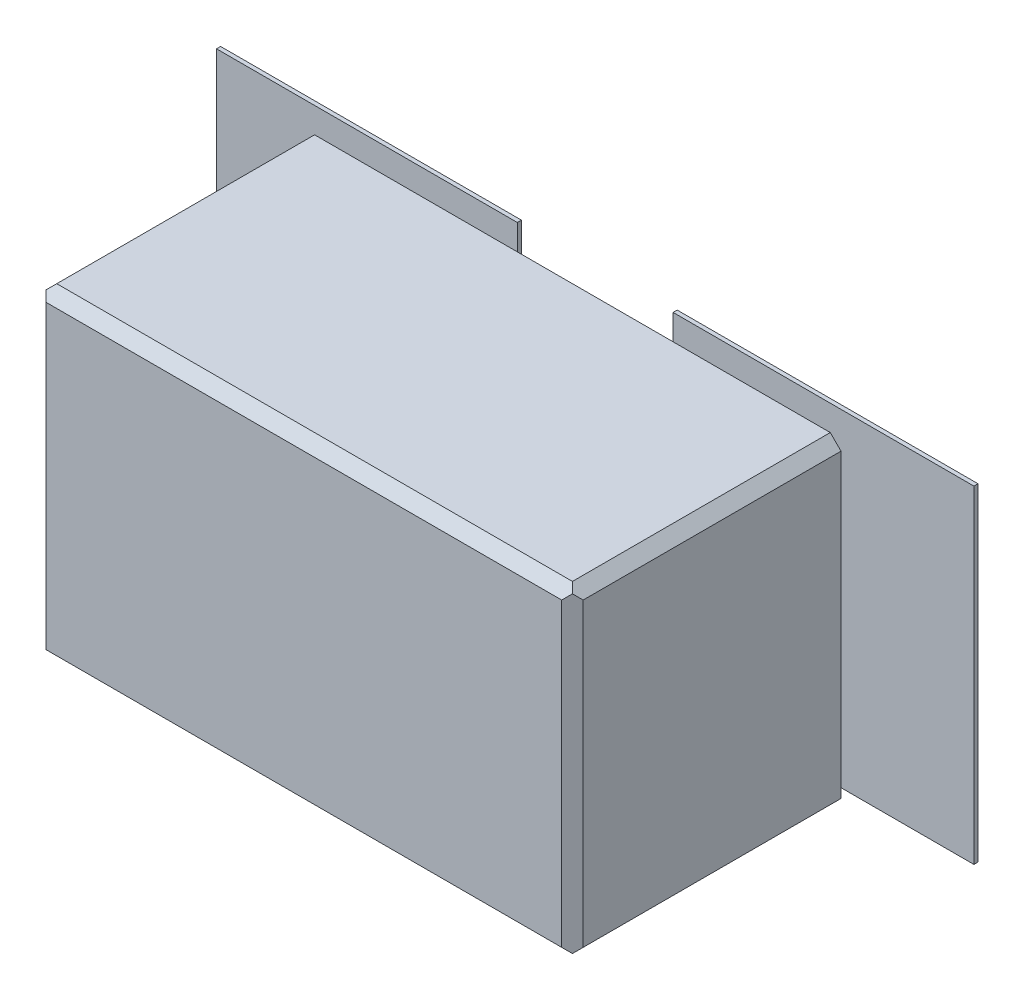
ISO-10303-21;
HEADER;
FILE_DESCRIPTION(('STEP AP214'),'2;1');
FILE_NAME('part.step','',(''),(''),'','','');
FILE_SCHEMA(('AUTOMOTIVE_DESIGN { 1 0 10303 214 1 1 1 1 }'));
ENDSEC;
DATA;
#1=APPLICATION_CONTEXT('core data for automotive mechanical design processes');
#2=APPLICATION_PROTOCOL_DEFINITION('international standard','automotive_design',2000,#1);
#3=PRODUCT_CONTEXT('',#1,'mechanical');
#4=PRODUCT('Part','Part','',(#3));
#5=PRODUCT_RELATED_PRODUCT_CATEGORY('part','',(#4));
#6=PRODUCT_DEFINITION_FORMATION('','',#4);
#7=PRODUCT_DEFINITION_CONTEXT('part definition',#1,'design');
#8=PRODUCT_DEFINITION('design','',#6,#7);
#9=PRODUCT_DEFINITION_SHAPE('','',#8);
#10=(LENGTH_UNIT() NAMED_UNIT(*) SI_UNIT(.MILLI.,.METRE.));
#11=(NAMED_UNIT(*) PLANE_ANGLE_UNIT() SI_UNIT($,.RADIAN.));
#12=(NAMED_UNIT(*) SI_UNIT($,.STERADIAN.) SOLID_ANGLE_UNIT());
#13=UNCERTAINTY_MEASURE_WITH_UNIT(LENGTH_MEASURE(1.E-05),#10,'distance_accuracy_value','');
#14=(GEOMETRIC_REPRESENTATION_CONTEXT(3) GLOBAL_UNCERTAINTY_ASSIGNED_CONTEXT((#13)) GLOBAL_UNIT_ASSIGNED_CONTEXT((#10,
#11,#12)) REPRESENTATION_CONTEXT('',''));
#15=CARTESIAN_POINT('',(0.,0.,0.));
#16=DIRECTION('',(0.,0.,1.));
#17=DIRECTION('',(1.,0.,0.));
#18=AXIS2_PLACEMENT_3D('',#15,#16,#17);
#19=CARTESIAN_POINT('',(0.,0.,0.08382));
#20=DIRECTION('',(0.,0.,1.));
#21=DIRECTION('',(1.,0.,0.));
#22=AXIS2_PLACEMENT_3D('',#19,#20,#21);
#23=PLANE('',#22);
#24=DIRECTION('',(0.,1.,0.));
#25=VECTOR('',#24,1.);
#26=CARTESIAN_POINT('',(-0.705,0.305,0.08382));
#27=LINE('',#26,#25);
#28=CARTESIAN_POINT('',(-0.705,-0.305,0.08382));
#29=VERTEX_POINT('',#28);
#30=CARTESIAN_POINT('',(-0.705,0.305,0.08382));
#31=VERTEX_POINT('',#30);
#32=EDGE_CURVE('P0_E68',#29,#31,#27,.T.);
#33=ORIENTED_EDGE('',*,*,#32,.F.);
#34=DIRECTION('',(1.,0.,0.));
#35=VECTOR('',#34,1.);
#36=CARTESIAN_POINT('',(-0.705,-0.305,0.08382));
#37=LINE('',#36,#35);
#38=CARTESIAN_POINT('',(-0.145,-0.305,0.08382));
#39=VERTEX_POINT('',#38);
#40=EDGE_CURVE('P0_E20',#39,#29,#37,.F.);
#41=ORIENTED_EDGE('',*,*,#40,.F.);
#42=DIRECTION('',(0.,1.,0.));
#43=VECTOR('',#42,1.);
#44=CARTESIAN_POINT('',(-0.145,-0.305,0.08382));
#45=LINE('',#44,#43);
#46=CARTESIAN_POINT('',(-0.145,0.305,0.08382));
#47=VERTEX_POINT('',#46);
#48=EDGE_CURVE('P0_E58',#47,#39,#45,.F.);
#49=ORIENTED_EDGE('',*,*,#48,.F.);
#50=DIRECTION('',(1.,0.,0.));
#51=VECTOR('',#50,1.);
#52=CARTESIAN_POINT('',(-0.145,0.305,0.08382));
#53=LINE('',#52,#51);
#54=EDGE_CURVE('P0_E53',#31,#47,#53,.T.);
#55=ORIENTED_EDGE('',*,*,#54,.F.);
#56=EDGE_LOOP('',(#33,#41,#49,#55));
#57=FACE_BOUND('',#56,.T.);
#58=ADVANCED_FACE('P0_F17',(#57),#23,.T.);
#59=CARTESIAN_POINT('',(-0.705,-0.305,0.0762));
#60=DIRECTION('',(0.,-1.,0.));
#61=DIRECTION('',(0.,0.,-1.));
#62=AXIS2_PLACEMENT_3D('',#59,#60,#61);
#63=PLANE('',#62);
#64=DIRECTION('',(0.,0.,1.));
#65=VECTOR('',#64,1.);
#66=CARTESIAN_POINT('',(-0.705,-0.305,0.0762));
#67=LINE('',#66,#65);
#68=CARTESIAN_POINT('',(-0.705,-0.305,0.0762));
#69=VERTEX_POINT('',#68);
#70=EDGE_CURVE('P0_E79',#69,#29,#67,.T.);
#71=ORIENTED_EDGE('',*,*,#70,.F.);
#72=DIRECTION('',(1.,0.,0.));
#73=VECTOR('',#72,1.);
#74=CARTESIAN_POINT('',(0.,-0.305,0.0762));
#75=LINE('',#74,#73);
#76=CARTESIAN_POINT('',(-0.145,-0.305,0.0762));
#77=VERTEX_POINT('',#76);
#78=EDGE_CURVE('P0_E74',#69,#77,#75,.T.);
#79=ORIENTED_EDGE('',*,*,#78,.T.);
#80=DIRECTION('',(0.,0.,-1.));
#81=VECTOR('',#80,1.);
#82=CARTESIAN_POINT('',(-0.145,-0.305,0.0762));
#83=LINE('',#82,#81);
#84=EDGE_CURVE('P0_E63',#39,#77,#83,.T.);
#85=ORIENTED_EDGE('',*,*,#84,.F.);
#86=ORIENTED_EDGE('',*,*,#40,.T.);
#87=EDGE_LOOP('',(#71,#79,#85,#86));
#88=FACE_BOUND('',#87,.T.);
#89=ADVANCED_FACE('P0_F73',(#88),#63,.T.);
#90=CARTESIAN_POINT('',(-0.145,-0.305,0.0762));
#91=DIRECTION('',(1.,0.,0.));
#92=DIRECTION('',(0.,0.,-1.));
#93=AXIS2_PLACEMENT_3D('',#90,#91,#92);
#94=PLANE('',#93);
#95=ORIENTED_EDGE('',*,*,#84,.T.);
#96=DIRECTION('',(0.,1.,0.));
#97=VECTOR('',#96,1.);
#98=CARTESIAN_POINT('',(-0.145,0.,0.0762));
#99=LINE('',#98,#97);
#100=CARTESIAN_POINT('',(-0.145,0.305,0.0762));
#101=VERTEX_POINT('',#100);
#102=EDGE_CURVE('P0_E84',#77,#101,#99,.T.);
#103=ORIENTED_EDGE('',*,*,#102,.T.);
#104=DIRECTION('',(0.,0.,1.));
#105=VECTOR('',#104,1.);
#106=CARTESIAN_POINT('',(-0.145,0.305,0.0762));
#107=LINE('',#106,#105);
#108=EDGE_CURVE('P0_E65',#47,#101,#107,.F.);
#109=ORIENTED_EDGE('',*,*,#108,.F.);
#110=ORIENTED_EDGE('',*,*,#48,.T.);
#111=EDGE_LOOP('',(#95,#103,#109,#110));
#112=FACE_BOUND('',#111,.T.);
#113=ADVANCED_FACE('P0_F60',(#112),#94,.T.);
#114=CARTESIAN_POINT('',(-0.145,0.305,0.0762));
#115=DIRECTION('',(0.,1.,0.));
#116=DIRECTION('',(0.,0.,1.));
#117=AXIS2_PLACEMENT_3D('',#114,#115,#116);
#118=PLANE('',#117);
#119=ORIENTED_EDGE('',*,*,#108,.T.);
#120=DIRECTION('',(1.,0.,0.));
#121=VECTOR('',#120,1.);
#122=CARTESIAN_POINT('',(0.,0.305,0.0762));
#123=LINE('',#122,#121);
#124=CARTESIAN_POINT('',(-0.705,0.305,0.0762));
#125=VERTEX_POINT('',#124);
#126=EDGE_CURVE('P0_E26',#101,#125,#123,.F.);
#127=ORIENTED_EDGE('',*,*,#126,.T.);
#128=DIRECTION('',(0.,0.,1.));
#129=VECTOR('',#128,1.);
#130=CARTESIAN_POINT('',(-0.705,0.305,0.0762));
#131=LINE('',#130,#129);
#132=EDGE_CURVE('P0_E34',#31,#125,#131,.F.);
#133=ORIENTED_EDGE('',*,*,#132,.F.);
#134=ORIENTED_EDGE('',*,*,#54,.T.);
#135=EDGE_LOOP('',(#119,#127,#133,#134));
#136=FACE_BOUND('',#135,.T.);
#137=ADVANCED_FACE('P0_F88',(#136),#118,.T.);
#138=CARTESIAN_POINT('',(-0.705,0.305,0.0762));
#139=DIRECTION('',(-1.,0.,0.));
#140=DIRECTION('',(0.,0.,1.));
#141=AXIS2_PLACEMENT_3D('',#138,#139,#140);
#142=PLANE('',#141);
#143=ORIENTED_EDGE('',*,*,#132,.T.);
#144=DIRECTION('',(0.,1.,0.));
#145=VECTOR('',#144,1.);
#146=CARTESIAN_POINT('',(-0.705,0.,0.0762));
#147=LINE('',#146,#145);
#148=EDGE_CURVE('P0_E11',#125,#69,#147,.F.);
#149=ORIENTED_EDGE('',*,*,#148,.T.);
#150=ORIENTED_EDGE('',*,*,#70,.T.);
#151=ORIENTED_EDGE('',*,*,#32,.T.);
#152=EDGE_LOOP('',(#143,#149,#150,#151));
#153=FACE_BOUND('',#152,.T.);
#154=ADVANCED_FACE('P0_F91',(#153),#142,.T.);
#155=CARTESIAN_POINT('',(0.,0.,0.0762));
#156=DIRECTION('',(0.,0.,1.));
#157=DIRECTION('',(1.,0.,0.));
#158=AXIS2_PLACEMENT_3D('',#155,#156,#157);
#159=PLANE('',#158);
#160=ORIENTED_EDGE('',*,*,#126,.F.);
#161=ORIENTED_EDGE('',*,*,#102,.F.);
#162=ORIENTED_EDGE('',*,*,#78,.F.);
#163=ORIENTED_EDGE('',*,*,#148,.F.);
#164=EDGE_LOOP('',(#160,#161,#162,#163));
#165=FACE_BOUND('',#164,.T.);
#166=ADVANCED_FACE('P0_F90',(#165),#159,.F.);
#167=CLOSED_SHELL('',(#58,#89,#113,#137,#154,#166));
#168=MANIFOLD_SOLID_BREP('P0_B1',#167);
#169=CARTESIAN_POINT('',(0.,0.,0.0862));
#170=DIRECTION('',(0.,0.,-1.));
#171=DIRECTION('',(-1.,0.,0.));
#172=AXIS2_PLACEMENT_3D('',#169,#170,#171);
#173=PLANE('',#172);
#174=DIRECTION('',(1.,0.,0.));
#175=VECTOR('',#174,1.);
#176=CARTESIAN_POINT('',(-0.4159973957868,0.25,0.0862));
#177=LINE('',#176,#175);
#178=CARTESIAN_POINT('',(-0.2159973957868,0.25,0.0862));
#179=VERTEX_POINT('',#178);
#180=CARTESIAN_POINT('',(-0.4159973957868,0.25,0.0862));
#181=VERTEX_POINT('',#180);
#182=EDGE_CURVE('P1_E184',#179,#181,#177,.F.);
#183=ORIENTED_EDGE('',*,*,#182,.F.);
#184=DIRECTION('',(0.,1.,0.));
#185=VECTOR('',#184,1.);
#186=CARTESIAN_POINT('',(-0.2159973957868,0.25,0.0862));
#187=LINE('',#186,#185);
#188=CARTESIAN_POINT('',(-0.2159973957868,-0.25,0.0862));
#189=VERTEX_POINT('',#188);
#190=EDGE_CURVE('P1_E212',#189,#179,#187,.T.);
#191=ORIENTED_EDGE('',*,*,#190,.F.);
#192=DIRECTION('',(1.,0.,0.));
#193=VECTOR('',#192,1.);
#194=CARTESIAN_POINT('',(-0.2159973957868,-0.25,0.0862));
#195=LINE('',#194,#193);
#196=CARTESIAN_POINT('',(-0.4659973957868,-0.25,0.0862));
#197=VERTEX_POINT('',#196);
#198=EDGE_CURVE('P1_E163',#197,#189,#195,.T.);
#199=ORIENTED_EDGE('',*,*,#198,.F.);
#200=DIRECTION('',(0.,1.,0.));
#201=VECTOR('',#200,1.);
#202=CARTESIAN_POINT('',(-0.4659973957868,-0.25,0.0862));
#203=LINE('',#202,#201);
#204=CARTESIAN_POINT('',(-0.4659973957868,0.2,0.0862));
#205=VERTEX_POINT('',#204);
#206=EDGE_CURVE('P1_E157',#205,#197,#203,.F.);
#207=ORIENTED_EDGE('',*,*,#206,.F.);
#208=CARTESIAN_POINT('',(-0.4659973957868,0.25,0.0862));
#209=DIRECTION('',(0.,0.,-1.));
#210=DIRECTION('',(-1.,0.,0.));
#211=AXIS2_PLACEMENT_3D('',#208,#209,#210);
#212=CIRCLE('',#211,0.05);
#213=EDGE_CURVE('P1_E20',#205,#181,#212,.F.);
#214=ORIENTED_EDGE('',*,*,#213,.T.);
#215=EDGE_LOOP('',(#183,#191,#199,#207,#214));
#216=FACE_BOUND('',#215,.T.);
#217=ADVANCED_FACE('P1_F17',(#216),#173,.T.);
#218=CARTESIAN_POINT('',(0.,0.,0.0862));
#219=DIRECTION('',(0.,0.,-1.));
#220=DIRECTION('',(-1.,0.,0.));
#221=AXIS2_PLACEMENT_3D('',#218,#219,#220);
#222=PLANE('',#221);
#223=DIRECTION('',(1.,0.,0.));
#224=VECTOR('',#223,1.);
#225=CARTESIAN_POINT('',(0.1840026042132,0.25,0.0862));
#226=LINE('',#225,#224);
#227=CARTESIAN_POINT('',(0.4340026042132,0.25,0.0862));
#228=VERTEX_POINT('',#227);
#229=CARTESIAN_POINT('',(0.1840026042132,0.25,0.0862));
#230=VERTEX_POINT('',#229);
#231=EDGE_CURVE('P1_E232',#228,#230,#226,.F.);
#232=ORIENTED_EDGE('',*,*,#231,.F.);
#233=DIRECTION('',(0.,1.,0.));
#234=VECTOR('',#233,1.);
#235=CARTESIAN_POINT('',(0.4340026042132,0.25,0.0862));
#236=LINE('',#235,#234);
#237=CARTESIAN_POINT('',(0.4340026042132,-0.25,0.0862));
#238=VERTEX_POINT('',#237);
#239=EDGE_CURVE('P1_E249',#238,#228,#236,.T.);
#240=ORIENTED_EDGE('',*,*,#239,.F.);
#241=DIRECTION('',(1.,0.,0.));
#242=VECTOR('',#241,1.);
#243=CARTESIAN_POINT('',(0.4340026042132,-0.25,0.0862));
#244=LINE('',#243,#242);
#245=CARTESIAN_POINT('',(0.1840026042132,-0.25,0.0862));
#246=VERTEX_POINT('',#245);
#247=EDGE_CURVE('P1_E247',#246,#238,#244,.T.);
#248=ORIENTED_EDGE('',*,*,#247,.F.);
#249=DIRECTION('',(0.,1.,0.));
#250=VECTOR('',#249,1.);
#251=CARTESIAN_POINT('',(0.1840026042132,-0.25,0.0862));
#252=LINE('',#251,#250);
#253=EDGE_CURVE('P1_E241',#230,#246,#252,.F.);
#254=ORIENTED_EDGE('',*,*,#253,.F.);
#255=EDGE_LOOP('',(#232,#240,#248,#254));
#256=FACE_BOUND('',#255,.T.);
#257=ADVANCED_FACE('P1_F273',(#256),#222,.T.);
#258=CARTESIAN_POINT('',(-0.2159973957868,0.25,0.1262));
#259=DIRECTION('',(1.,0.,0.));
#260=DIRECTION('',(0.,0.,-1.));
#261=AXIS2_PLACEMENT_3D('',#258,#259,#260);
#262=PLANE('',#261);
#263=DIRECTION('',(0.,0.,1.));
#264=VECTOR('',#263,1.);
#265=CARTESIAN_POINT('',(-0.2159973957868,0.25,0.1262));
#266=LINE('',#265,#264);
#267=CARTESIAN_POINT('',(-0.2159973957868,0.25,0.1262));
#268=VERTEX_POINT('',#267);
#269=EDGE_CURVE('P1_E182',#268,#179,#266,.F.);
#270=ORIENTED_EDGE('',*,*,#269,.F.);
#271=DIRECTION('',(0.,1.,0.));
#272=VECTOR('',#271,1.);
#273=CARTESIAN_POINT('',(-0.2159973957868,0.,0.1262));
#274=LINE('',#273,#272);
#275=CARTESIAN_POINT('',(-0.2159973957868,-0.25,0.1262));
#276=VERTEX_POINT('',#275);
#277=EDGE_CURVE('P1_E194',#268,#276,#274,.F.);
#278=ORIENTED_EDGE('',*,*,#277,.T.);
#279=DIRECTION('',(0.,0.,-1.));
#280=VECTOR('',#279,1.);
#281=CARTESIAN_POINT('',(-0.2159973957868,-0.25,0.1262));
#282=LINE('',#281,#280);
#283=EDGE_CURVE('P1_E168',#189,#276,#282,.F.);
#284=ORIENTED_EDGE('',*,*,#283,.F.);
#285=ORIENTED_EDGE('',*,*,#190,.T.);
#286=EDGE_LOOP('',(#270,#278,#284,#285));
#287=FACE_BOUND('',#286,.T.);
#288=ADVANCED_FACE('P1_F262',(#287),#262,.T.);
#289=CARTESIAN_POINT('',(-0.2159973957868,-0.25,0.1262));
#290=DIRECTION('',(0.,-1.,0.));
#291=DIRECTION('',(0.,0.,-1.));
#292=AXIS2_PLACEMENT_3D('',#289,#290,#291);
#293=PLANE('',#292);
#294=ORIENTED_EDGE('',*,*,#283,.T.);
#295=DIRECTION('',(1.,0.,0.));
#296=VECTOR('',#295,1.);
#297=CARTESIAN_POINT('',(0.,-0.25,0.1262));
#298=LINE('',#297,#296);
#299=CARTESIAN_POINT('',(-0.4659973957868,-0.25,0.1262));
#300=VERTEX_POINT('',#299);
#301=EDGE_CURVE('P1_E196',#276,#300,#298,.F.);
#302=ORIENTED_EDGE('',*,*,#301,.T.);
#303=DIRECTION('',(0.,0.,1.));
#304=VECTOR('',#303,1.);
#305=CARTESIAN_POINT('',(-0.4659973957868,-0.25,0.1262));
#306=LINE('',#305,#304);
#307=EDGE_CURVE('P1_E167',#197,#300,#306,.T.);
#308=ORIENTED_EDGE('',*,*,#307,.F.);
#309=ORIENTED_EDGE('',*,*,#198,.T.);
#310=EDGE_LOOP('',(#294,#302,#308,#309));
#311=FACE_BOUND('',#310,.T.);
#312=ADVANCED_FACE('P1_F264',(#311),#293,.T.);
#313=CARTESIAN_POINT('',(-0.4659973957868,-0.25,0.1262));
#314=DIRECTION('',(-1.,0.,0.));
#315=DIRECTION('',(0.,0.,1.));
#316=AXIS2_PLACEMENT_3D('',#313,#314,#315);
#317=PLANE('',#316);
#318=ORIENTED_EDGE('',*,*,#307,.T.);
#319=DIRECTION('',(0.,1.,0.));
#320=VECTOR('',#319,1.);
#321=CARTESIAN_POINT('',(-0.4659973957868,0.,0.1262));
#322=LINE('',#321,#320);
#323=CARTESIAN_POINT('',(-0.4659973957868,0.2,0.1262));
#324=VERTEX_POINT('',#323);
#325=EDGE_CURVE('P1_E174',#300,#324,#322,.T.);
#326=ORIENTED_EDGE('',*,*,#325,.T.);
#327=DIRECTION('',(0.,0.,-1.));
#328=VECTOR('',#327,1.);
#329=CARTESIAN_POINT('',(-0.4659973957868,0.2,0.1262));
#330=LINE('',#329,#328);
#331=EDGE_CURVE('P1_E171',#324,#205,#330,.T.);
#332=ORIENTED_EDGE('',*,*,#331,.T.);
#333=ORIENTED_EDGE('',*,*,#206,.T.);
#334=EDGE_LOOP('',(#318,#326,#332,#333));
#335=FACE_BOUND('',#334,.T.);
#336=ADVANCED_FACE('P1_F172',(#335),#317,.T.);
#337=CARTESIAN_POINT('',(-0.4659973957868,0.25,0.1262));
#338=DIRECTION('',(0.,0.,-1.));
#339=DIRECTION('',(-1.,0.,0.));
#340=AXIS2_PLACEMENT_3D('',#337,#338,#339);
#341=CYLINDRICAL_SURFACE('',#340,0.05);
#342=ORIENTED_EDGE('',*,*,#213,.F.);
#343=ORIENTED_EDGE('',*,*,#331,.F.);
#344=CARTESIAN_POINT('',(-0.4659973957868,0.25,0.1262));
#345=DIRECTION('',(0.,0.,-1.));
#346=DIRECTION('',(-1.,0.,0.));
#347=AXIS2_PLACEMENT_3D('',#344,#345,#346);
#348=CIRCLE('',#347,0.05);
#349=CARTESIAN_POINT('',(-0.4159973957868,0.25,0.1262));
#350=VERTEX_POINT('',#349);
#351=EDGE_CURVE('P1_E220',#324,#350,#348,.F.);
#352=ORIENTED_EDGE('',*,*,#351,.T.);
#353=DIRECTION('',(0.,0.,1.));
#354=VECTOR('',#353,1.);
#355=CARTESIAN_POINT('',(-0.4159973957868,0.25,0.1262));
#356=LINE('',#355,#354);
#357=EDGE_CURVE('P1_E180',#181,#350,#356,.T.);
#358=ORIENTED_EDGE('',*,*,#357,.F.);
#359=EDGE_LOOP('',(#342,#343,#352,#358));
#360=FACE_BOUND('',#359,.T.);
#361=ADVANCED_FACE('P1_F178',(#360),#341,.F.);
#362=CARTESIAN_POINT('',(-0.4159973957868,0.25,0.1262));
#363=DIRECTION('',(0.,1.,0.));
#364=DIRECTION('',(0.,0.,1.));
#365=AXIS2_PLACEMENT_3D('',#362,#363,#364);
#366=PLANE('',#365);
#367=ORIENTED_EDGE('',*,*,#357,.T.);
#368=DIRECTION('',(1.,0.,0.));
#369=VECTOR('',#368,1.);
#370=CARTESIAN_POINT('',(0.,0.25,0.1262));
#371=LINE('',#370,#369);
#372=EDGE_CURVE('P1_E221',#350,#268,#371,.T.);
#373=ORIENTED_EDGE('',*,*,#372,.T.);
#374=ORIENTED_EDGE('',*,*,#269,.T.);
#375=ORIENTED_EDGE('',*,*,#182,.T.);
#376=EDGE_LOOP('',(#367,#373,#374,#375));
#377=FACE_BOUND('',#376,.T.);
#378=ADVANCED_FACE('P1_F254',(#377),#366,.T.);
#379=CARTESIAN_POINT('',(0.4340026042132,0.25,0.1262));
#380=DIRECTION('',(1.,0.,0.));
#381=DIRECTION('',(0.,0.,-1.));
#382=AXIS2_PLACEMENT_3D('',#379,#380,#381);
#383=PLANE('',#382);
#384=DIRECTION('',(0.,0.,1.));
#385=VECTOR('',#384,1.);
#386=CARTESIAN_POINT('',(0.4340026042132,0.25,0.1262));
#387=LINE('',#386,#385);
#388=CARTESIAN_POINT('',(0.4340026042132,0.25,0.1262));
#389=VERTEX_POINT('',#388);
#390=EDGE_CURVE('P1_E235',#389,#228,#387,.F.);
#391=ORIENTED_EDGE('',*,*,#390,.F.);
#392=DIRECTION('',(0.,1.,0.));
#393=VECTOR('',#392,1.);
#394=CARTESIAN_POINT('',(0.4340026042132,0.,0.1262));
#395=LINE('',#394,#393);
#396=CARTESIAN_POINT('',(0.4340026042132,-0.25,0.1262));
#397=VERTEX_POINT('',#396);
#398=EDGE_CURVE('P1_E222',#389,#397,#395,.F.);
#399=ORIENTED_EDGE('',*,*,#398,.T.);
#400=DIRECTION('',(0.,0.,-1.));
#401=VECTOR('',#400,1.);
#402=CARTESIAN_POINT('',(0.4340026042132,-0.25,0.1262));
#403=LINE('',#402,#401);
#404=EDGE_CURVE('P1_E244',#238,#397,#403,.F.);
#405=ORIENTED_EDGE('',*,*,#404,.F.);
#406=ORIENTED_EDGE('',*,*,#239,.T.);
#407=EDGE_LOOP('',(#391,#399,#405,#406));
#408=FACE_BOUND('',#407,.T.);
#409=ADVANCED_FACE('P1_F344',(#408),#383,.T.);
#410=CARTESIAN_POINT('',(0.4340026042132,-0.25,0.1262));
#411=DIRECTION('',(0.,-1.,0.));
#412=DIRECTION('',(0.,0.,-1.));
#413=AXIS2_PLACEMENT_3D('',#410,#411,#412);
#414=PLANE('',#413);
#415=ORIENTED_EDGE('',*,*,#404,.T.);
#416=DIRECTION('',(1.,0.,0.));
#417=VECTOR('',#416,1.);
#418=CARTESIAN_POINT('',(0.,-0.25,0.1262));
#419=LINE('',#418,#417);
#420=CARTESIAN_POINT('',(0.1840026042132,-0.25,0.1262));
#421=VERTEX_POINT('',#420);
#422=EDGE_CURVE('P1_E513',#397,#421,#419,.F.);
#423=ORIENTED_EDGE('',*,*,#422,.T.);
#424=DIRECTION('',(0.,0.,1.));
#425=VECTOR('',#424,1.);
#426=CARTESIAN_POINT('',(0.1840026042132,-0.25,0.1262));
#427=LINE('',#426,#425);
#428=EDGE_CURVE('P1_E238',#246,#421,#427,.T.);
#429=ORIENTED_EDGE('',*,*,#428,.F.);
#430=ORIENTED_EDGE('',*,*,#247,.T.);
#431=EDGE_LOOP('',(#415,#423,#429,#430));
#432=FACE_BOUND('',#431,.T.);
#433=ADVANCED_FACE('P1_F340',(#432),#414,.T.);
#434=CARTESIAN_POINT('',(0.1840026042132,-0.25,0.1262));
#435=DIRECTION('',(-1.,0.,0.));
#436=DIRECTION('',(0.,0.,1.));
#437=AXIS2_PLACEMENT_3D('',#434,#435,#436);
#438=PLANE('',#437);
#439=ORIENTED_EDGE('',*,*,#428,.T.);
#440=DIRECTION('',(0.,1.,0.));
#441=VECTOR('',#440,1.);
#442=CARTESIAN_POINT('',(0.1840026042132,0.,0.1262));
#443=LINE('',#442,#441);
#444=CARTESIAN_POINT('',(0.1840026042132,0.25,0.1262));
#445=VERTEX_POINT('',#444);
#446=EDGE_CURVE('P1_E517',#421,#445,#443,.T.);
#447=ORIENTED_EDGE('',*,*,#446,.T.);
#448=DIRECTION('',(0.,0.,1.));
#449=VECTOR('',#448,1.);
#450=CARTESIAN_POINT('',(0.1840026042132,0.25,0.1262));
#451=LINE('',#450,#449);
#452=EDGE_CURVE('P1_E197',#230,#445,#451,.T.);
#453=ORIENTED_EDGE('',*,*,#452,.F.);
#454=ORIENTED_EDGE('',*,*,#253,.T.);
#455=EDGE_LOOP('',(#439,#447,#453,#454));
#456=FACE_BOUND('',#455,.T.);
#457=ADVANCED_FACE('P1_F336',(#456),#438,.T.);
#458=CARTESIAN_POINT('',(0.1840026042132,0.25,0.1262));
#459=DIRECTION('',(0.,1.,0.));
#460=DIRECTION('',(0.,0.,1.));
#461=AXIS2_PLACEMENT_3D('',#458,#459,#460);
#462=PLANE('',#461);
#463=ORIENTED_EDGE('',*,*,#452,.T.);
#464=DIRECTION('',(1.,0.,0.));
#465=VECTOR('',#464,1.);
#466=CARTESIAN_POINT('',(0.,0.25,0.1262));
#467=LINE('',#466,#465);
#468=EDGE_CURVE('P1_E510',#445,#389,#467,.T.);
#469=ORIENTED_EDGE('',*,*,#468,.T.);
#470=ORIENTED_EDGE('',*,*,#390,.T.);
#471=ORIENTED_EDGE('',*,*,#231,.T.);
#472=EDGE_LOOP('',(#463,#469,#470,#471));
#473=FACE_BOUND('',#472,.T.);
#474=ADVANCED_FACE('P1_F332',(#473),#462,.T.);
#475=CARTESIAN_POINT('',(0.,0.,0.1262));
#476=DIRECTION('',(0.,0.,1.));
#477=DIRECTION('',(1.,0.,0.));
#478=AXIS2_PLACEMENT_3D('',#475,#476,#477);
#479=PLANE('',#478);
#480=ORIENTED_EDGE('',*,*,#446,.F.);
#481=ORIENTED_EDGE('',*,*,#422,.F.);
#482=ORIENTED_EDGE('',*,*,#398,.F.);
#483=ORIENTED_EDGE('',*,*,#468,.F.);
#484=EDGE_LOOP('',(#480,#481,#482,#483));
#485=FACE_BOUND('',#484,.T.);
#486=ORIENTED_EDGE('',*,*,#351,.F.);
#487=ORIENTED_EDGE('',*,*,#325,.F.);
#488=ORIENTED_EDGE('',*,*,#301,.F.);
#489=ORIENTED_EDGE('',*,*,#277,.F.);
#490=ORIENTED_EDGE('',*,*,#372,.F.);
#491=EDGE_LOOP('',(#486,#487,#488,#489,#490));
#492=FACE_BOUND('',#491,.T.);
#493=DIRECTION('',(0.707106781186548,0.707106781186548,0.));
#494=VECTOR('',#493,1.);
#495=CARTESIAN_POINT('',(0.49,-0.29,0.1262));
#496=LINE('',#495,#494);
#497=CARTESIAN_POINT('',(0.48,-0.3,0.1262));
#498=VERTEX_POINT('',#497);
#499=CARTESIAN_POINT('',(0.5,-0.28,0.1262));
#500=VERTEX_POINT('',#499);
#501=EDGE_CURVE('P1_E552',#498,#500,#496,.T.);
#502=ORIENTED_EDGE('',*,*,#501,.F.);
#503=DIRECTION('',(1.,0.,0.));
#504=VECTOR('',#503,1.);
#505=CARTESIAN_POINT('',(-0.5,-0.3,0.1262));
#506=LINE('',#505,#504);
#507=CARTESIAN_POINT('',(-0.48,-0.3,0.1262));
#508=VERTEX_POINT('',#507);
#509=EDGE_CURVE('P1_E542',#508,#498,#506,.T.);
#510=ORIENTED_EDGE('',*,*,#509,.F.);
#511=DIRECTION('',(0.707106781186548,-0.707106781186548,0.));
#512=VECTOR('',#511,1.);
#513=CARTESIAN_POINT('',(-0.49,-0.29,0.1262));
#514=LINE('',#513,#512);
#515=CARTESIAN_POINT('',(-0.5,-0.28,0.1262));
#516=VERTEX_POINT('',#515);
#517=EDGE_CURVE('P1_E537',#516,#508,#514,.T.);
#518=ORIENTED_EDGE('',*,*,#517,.F.);
#519=DIRECTION('',(0.,1.,0.));
#520=VECTOR('',#519,1.);
#521=CARTESIAN_POINT('',(-0.5,0.3,0.1262));
#522=LINE('',#521,#520);
#523=CARTESIAN_POINT('',(-0.5,0.28,0.1262));
#524=VERTEX_POINT('',#523);
#525=EDGE_CURVE('P1_E532',#524,#516,#522,.F.);
#526=ORIENTED_EDGE('',*,*,#525,.F.);
#527=DIRECTION('',(-0.707106781186548,-0.707106781186548,0.));
#528=VECTOR('',#527,1.);
#529=CARTESIAN_POINT('',(-0.49,0.29,0.1262));
#530=LINE('',#529,#528);
#531=CARTESIAN_POINT('',(-0.48,0.3,0.1262));
#532=VERTEX_POINT('',#531);
#533=EDGE_CURVE('P1_E527',#532,#524,#530,.T.);
#534=ORIENTED_EDGE('',*,*,#533,.F.);
#535=DIRECTION('',(1.,0.,0.));
#536=VECTOR('',#535,1.);
#537=CARTESIAN_POINT('',(0.5,0.3,0.1262));
#538=LINE('',#537,#536);
#539=CARTESIAN_POINT('',(0.48,0.3,0.1262));
#540=VERTEX_POINT('',#539);
#541=EDGE_CURVE('P1_E522',#540,#532,#538,.F.);
#542=ORIENTED_EDGE('',*,*,#541,.F.);
#543=DIRECTION('',(-0.707106781186548,0.707106781186548,0.));
#544=VECTOR('',#543,1.);
#545=CARTESIAN_POINT('',(0.49,0.29,0.1262));
#546=LINE('',#545,#544);
#547=CARTESIAN_POINT('',(0.5,0.28,0.1262));
#548=VERTEX_POINT('',#547);
#549=EDGE_CURVE('P1_E546',#548,#540,#546,.T.);
#550=ORIENTED_EDGE('',*,*,#549,.F.);
#551=DIRECTION('',(0.,1.,0.));
#552=VECTOR('',#551,1.);
#553=CARTESIAN_POINT('',(0.5,-0.3,0.1262));
#554=LINE('',#553,#552);
#555=EDGE_CURVE('P1_E557',#500,#548,#554,.T.);
#556=ORIENTED_EDGE('',*,*,#555,.F.);
#557=EDGE_LOOP('',(#502,#510,#518,#526,#534,#542,#550,#556));
#558=FACE_BOUND('',#557,.T.);
#559=ADVANCED_FACE('P1_F257',(#485,#492,#558),#479,.F.);
#560=CARTESIAN_POINT('',(0.5,0.3,0.0762));
#561=DIRECTION('',(0.,1.,0.));
#562=DIRECTION('',(0.,0.,1.));
#563=AXIS2_PLACEMENT_3D('',#560,#561,#562);
#564=PLANE('',#563);
#565=DIRECTION('',(1.,0.,0.));
#566=VECTOR('',#565,1.);
#567=CARTESIAN_POINT('',(0.,0.3,0.6062));
#568=LINE('',#567,#566);
#569=CARTESIAN_POINT('',(0.48,0.3,0.6062));
#570=VERTEX_POINT('',#569);
#571=CARTESIAN_POINT('',(-0.48,0.3,0.6062));
#572=VERTEX_POINT('',#571);
#573=EDGE_CURVE('P1_E566',#570,#572,#568,.F.);
#574=ORIENTED_EDGE('',*,*,#573,.F.);
#575=DIRECTION('',(0.,0.,1.));
#576=VECTOR('',#575,1.);
#577=CARTESIAN_POINT('',(0.48,0.3,0.3762));
#578=LINE('',#577,#576);
#579=EDGE_CURVE('P1_E544',#540,#570,#578,.T.);
#580=ORIENTED_EDGE('',*,*,#579,.F.);
#581=ORIENTED_EDGE('',*,*,#541,.T.);
#582=DIRECTION('',(0.,0.,1.));
#583=VECTOR('',#582,1.);
#584=CARTESIAN_POINT('',(-0.48,0.3,0.3762));
#585=LINE('',#584,#583);
#586=EDGE_CURVE('P1_E524',#572,#532,#585,.F.);
#587=ORIENTED_EDGE('',*,*,#586,.F.);
#588=EDGE_LOOP('',(#574,#580,#581,#587));
#589=FACE_BOUND('',#588,.T.);
#590=ADVANCED_FACE('P1_F325',(#589),#564,.T.);
#591=CARTESIAN_POINT('',(-0.49,0.29,0.3762));
#592=DIRECTION('',(-0.707106781186548,0.707106781186548,0.));
#593=DIRECTION('',(-0.707106781186548,-0.707106781186548,0.));
#594=AXIS2_PLACEMENT_3D('',#591,#592,#593);
#595=PLANE('',#594);
#596=ORIENTED_EDGE('',*,*,#586,.T.);
#597=ORIENTED_EDGE('',*,*,#533,.T.);
#598=DIRECTION('',(0.,0.,1.));
#599=VECTOR('',#598,1.);
#600=CARTESIAN_POINT('',(-0.5,0.28,0.0762));
#601=LINE('',#600,#599);
#602=CARTESIAN_POINT('',(-0.5,0.28,0.6062));
#603=VERTEX_POINT('',#602);
#604=EDGE_CURVE('P1_E529',#603,#524,#601,.F.);
#605=ORIENTED_EDGE('',*,*,#604,.F.);
#606=DIRECTION('',(-0.577350269189627,-0.577350269189624,-0.577350269189627));
#607=VECTOR('',#606,1.);
#608=CARTESIAN_POINT('',(-0.49,0.29,0.6162));
#609=LINE('',#608,#607);
#610=CARTESIAN_POINT('',(-0.49,0.29,0.6162));
#611=VERTEX_POINT('',#610);
#612=EDGE_CURVE('P1_E576',#611,#603,#609,.T.);
#613=ORIENTED_EDGE('',*,*,#612,.F.);
#614=DIRECTION('',(-0.577350269189624,-0.577350269189627,0.577350269189627));
#615=VECTOR('',#614,1.);
#616=CARTESIAN_POINT('',(-0.48,0.3,0.6062));
#617=LINE('',#616,#615);
#618=EDGE_CURVE('P1_E569',#572,#611,#617,.T.);
#619=ORIENTED_EDGE('',*,*,#618,.F.);
#620=EDGE_LOOP('',(#596,#597,#605,#613,#619));
#621=FACE_BOUND('',#620,.T.);
#622=ADVANCED_FACE('P1_F321',(#621),#595,.T.);
#623=CARTESIAN_POINT('',(-0.5,0.3,0.0762));
#624=DIRECTION('',(-1.,0.,0.));
#625=DIRECTION('',(0.,0.,1.));
#626=AXIS2_PLACEMENT_3D('',#623,#624,#625);
#627=PLANE('',#626);
#628=ORIENTED_EDGE('',*,*,#525,.T.);
#629=DIRECTION('',(0.,0.,1.));
#630=VECTOR('',#629,1.);
#631=CARTESIAN_POINT('',(-0.5,-0.28,0.3762));
#632=LINE('',#631,#630);
#633=CARTESIAN_POINT('',(-0.5,-0.28,0.6062));
#634=VERTEX_POINT('',#633);
#635=EDGE_CURVE('P1_E534',#634,#516,#632,.F.);
#636=ORIENTED_EDGE('',*,*,#635,.F.);
#637=DIRECTION('',(0.,1.,0.));
#638=VECTOR('',#637,1.);
#639=CARTESIAN_POINT('',(-0.5,0.,0.6062));
#640=LINE('',#639,#638);
#641=EDGE_CURVE('P1_E579',#603,#634,#640,.F.);
#642=ORIENTED_EDGE('',*,*,#641,.F.);
#643=ORIENTED_EDGE('',*,*,#604,.T.);
#644=EDGE_LOOP('',(#628,#636,#642,#643));
#645=FACE_BOUND('',#644,.T.);
#646=ADVANCED_FACE('P1_F317',(#645),#627,.T.);
#647=CARTESIAN_POINT('',(-0.49,-0.29,0.3762));
#648=DIRECTION('',(-0.707106781186548,-0.707106781186548,0.));
#649=DIRECTION('',(0.707106781186548,-0.707106781186548,0.));
#650=AXIS2_PLACEMENT_3D('',#647,#648,#649);
#651=PLANE('',#650);
#652=ORIENTED_EDGE('',*,*,#635,.T.);
#653=ORIENTED_EDGE('',*,*,#517,.T.);
#654=DIRECTION('',(0.,0.,-1.));
#655=VECTOR('',#654,1.);
#656=CARTESIAN_POINT('',(-0.48,-0.3,0.0762));
#657=LINE('',#656,#655);
#658=CARTESIAN_POINT('',(-0.48,-0.3,0.6062));
#659=VERTEX_POINT('',#658);
#660=EDGE_CURVE('P1_E539',#659,#508,#657,.T.);
#661=ORIENTED_EDGE('',*,*,#660,.F.);
#662=DIRECTION('',(0.577350269189624,-0.577350269189627,-0.577350269189627));
#663=VECTOR('',#662,1.);
#664=CARTESIAN_POINT('',(-0.49,-0.29,0.6162));
#665=LINE('',#664,#663);
#666=CARTESIAN_POINT('',(-0.49,-0.29,0.6162));
#667=VERTEX_POINT('',#666);
#668=EDGE_CURVE('P1_E587',#667,#659,#665,.T.);
#669=ORIENTED_EDGE('',*,*,#668,.F.);
#670=DIRECTION('',(0.577350269189627,-0.577350269189624,0.577350269189627));
#671=VECTOR('',#670,1.);
#672=CARTESIAN_POINT('',(-0.5,-0.28,0.6062));
#673=LINE('',#672,#671);
#674=EDGE_CURVE('P1_E571',#634,#667,#673,.T.);
#675=ORIENTED_EDGE('',*,*,#674,.F.);
#676=EDGE_LOOP('',(#652,#653,#661,#669,#675));
#677=FACE_BOUND('',#676,.T.);
#678=ADVANCED_FACE('P1_F313',(#677),#651,.T.);
#679=CARTESIAN_POINT('',(-0.5,-0.3,0.0762));
#680=DIRECTION('',(0.,-1.,0.));
#681=DIRECTION('',(0.,0.,-1.));
#682=AXIS2_PLACEMENT_3D('',#679,#680,#681);
#683=PLANE('',#682);
#684=ORIENTED_EDGE('',*,*,#509,.T.);
#685=DIRECTION('',(0.,0.,1.));
#686=VECTOR('',#685,1.);
#687=CARTESIAN_POINT('',(0.48,-0.3,0.3762));
#688=LINE('',#687,#686);
#689=CARTESIAN_POINT('',(0.48,-0.3,0.6062));
#690=VERTEX_POINT('',#689);
#691=EDGE_CURVE('P1_E549',#690,#498,#688,.F.);
#692=ORIENTED_EDGE('',*,*,#691,.F.);
#693=DIRECTION('',(1.,0.,0.));
#694=VECTOR('',#693,1.);
#695=CARTESIAN_POINT('',(0.,-0.3,0.6062));
#696=LINE('',#695,#694);
#697=EDGE_CURVE('P1_E590',#659,#690,#696,.T.);
#698=ORIENTED_EDGE('',*,*,#697,.F.);
#699=ORIENTED_EDGE('',*,*,#660,.T.);
#700=EDGE_LOOP('',(#684,#692,#698,#699));
#701=FACE_BOUND('',#700,.T.);
#702=ADVANCED_FACE('P1_F309',(#701),#683,.T.);
#703=CARTESIAN_POINT('',(0.49,0.29,0.3762));
#704=DIRECTION('',(0.707106781186548,0.707106781186548,0.));
#705=DIRECTION('',(-0.707106781186548,0.707106781186548,0.));
#706=AXIS2_PLACEMENT_3D('',#703,#704,#705);
#707=PLANE('',#706);
#708=DIRECTION('',(0.,0.,-1.));
#709=VECTOR('',#708,1.);
#710=CARTESIAN_POINT('',(0.5,0.28,0.0762));
#711=LINE('',#710,#709);
#712=CARTESIAN_POINT('',(0.5,0.28,0.6062));
#713=VERTEX_POINT('',#712);
#714=EDGE_CURVE('P1_E560',#548,#713,#711,.F.);
#715=ORIENTED_EDGE('',*,*,#714,.F.);
#716=ORIENTED_EDGE('',*,*,#549,.T.);
#717=ORIENTED_EDGE('',*,*,#579,.T.);
#718=DIRECTION('',(-0.577350269189624,0.577350269189627,-0.577350269189627));
#719=VECTOR('',#718,1.);
#720=CARTESIAN_POINT('',(0.49,0.29,0.6162));
#721=LINE('',#720,#719);
#722=CARTESIAN_POINT('',(0.49,0.29,0.6162));
#723=VERTEX_POINT('',#722);
#724=EDGE_CURVE('P1_E563',#723,#570,#721,.T.);
#725=ORIENTED_EDGE('',*,*,#724,.F.);
#726=DIRECTION('',(-0.577350269189627,0.577350269189624,0.577350269189627));
#727=VECTOR('',#726,1.);
#728=CARTESIAN_POINT('',(0.5,0.28,0.6062));
#729=LINE('',#728,#727);
#730=EDGE_CURVE('P1_E593',#713,#723,#729,.T.);
#731=ORIENTED_EDGE('',*,*,#730,.F.);
#732=EDGE_LOOP('',(#715,#716,#717,#725,#731));
#733=FACE_BOUND('',#732,.T.);
#734=ADVANCED_FACE('P1_F305',(#733),#707,.T.);
#735=CARTESIAN_POINT('',(0.49,-0.29,0.3762));
#736=DIRECTION('',(0.707106781186548,-0.707106781186548,0.));
#737=DIRECTION('',(0.707106781186548,0.707106781186548,0.));
#738=AXIS2_PLACEMENT_3D('',#735,#736,#737);
#739=PLANE('',#738);
#740=ORIENTED_EDGE('',*,*,#691,.T.);
#741=ORIENTED_EDGE('',*,*,#501,.T.);
#742=DIRECTION('',(0.,0.,-1.));
#743=VECTOR('',#742,1.);
#744=CARTESIAN_POINT('',(0.5,-0.28,0.0762));
#745=LINE('',#744,#743);
#746=CARTESIAN_POINT('',(0.5,-0.28,0.6062));
#747=VERTEX_POINT('',#746);
#748=EDGE_CURVE('P1_E554',#747,#500,#745,.T.);
#749=ORIENTED_EDGE('',*,*,#748,.F.);
#750=DIRECTION('',(0.577350269189627,0.577350269189624,-0.577350269189627));
#751=VECTOR('',#750,1.);
#752=CARTESIAN_POINT('',(0.49,-0.29,0.6162));
#753=LINE('',#752,#751);
#754=CARTESIAN_POINT('',(0.49,-0.29,0.6162));
#755=VERTEX_POINT('',#754);
#756=EDGE_CURVE('P1_E600',#755,#747,#753,.T.);
#757=ORIENTED_EDGE('',*,*,#756,.F.);
#758=DIRECTION('',(0.577350269189624,0.577350269189627,0.577350269189627));
#759=VECTOR('',#758,1.);
#760=CARTESIAN_POINT('',(0.48,-0.3,0.6062));
#761=LINE('',#760,#759);
#762=EDGE_CURVE('P1_E582',#690,#755,#761,.T.);
#763=ORIENTED_EDGE('',*,*,#762,.F.);
#764=EDGE_LOOP('',(#740,#741,#749,#757,#763));
#765=FACE_BOUND('',#764,.T.);
#766=ADVANCED_FACE('P1_F301',(#765),#739,.T.);
#767=CARTESIAN_POINT('',(0.5,-0.3,0.0762));
#768=DIRECTION('',(1.,0.,0.));
#769=DIRECTION('',(0.,0.,-1.));
#770=AXIS2_PLACEMENT_3D('',#767,#768,#769);
#771=PLANE('',#770);
#772=ORIENTED_EDGE('',*,*,#555,.T.);
#773=ORIENTED_EDGE('',*,*,#714,.T.);
#774=DIRECTION('',(0.,1.,0.));
#775=VECTOR('',#774,1.);
#776=CARTESIAN_POINT('',(0.5,0.,0.6062));
#777=LINE('',#776,#775);
#778=EDGE_CURVE('P1_E603',#747,#713,#777,.T.);
#779=ORIENTED_EDGE('',*,*,#778,.F.);
#780=ORIENTED_EDGE('',*,*,#748,.T.);
#781=EDGE_LOOP('',(#772,#773,#779,#780));
#782=FACE_BOUND('',#781,.T.);
#783=ADVANCED_FACE('P1_F297',(#782),#771,.T.);
#784=CARTESIAN_POINT('',(0.,0.29,0.6162));
#785=DIRECTION('',(0.,0.707106781186548,0.707106781186548));
#786=DIRECTION('',(0.,-0.707106781186548,0.707106781186548));
#787=AXIS2_PLACEMENT_3D('',#784,#785,#786);
#788=PLANE('',#787);
#789=DIRECTION('',(-0.577350269189627,0.577350269189624,-0.577350269189627));
#790=VECTOR('',#789,1.);
#791=CARTESIAN_POINT('',(-0.48,0.28,0.6262));
#792=LINE('',#791,#790);
#793=CARTESIAN_POINT('',(-0.48,0.28,0.6262));
#794=VERTEX_POINT('',#793);
#795=EDGE_CURVE('P1_E573',#794,#611,#792,.T.);
#796=ORIENTED_EDGE('',*,*,#795,.F.);
#797=DIRECTION('',(1.,0.,0.));
#798=VECTOR('',#797,1.);
#799=CARTESIAN_POINT('',(0.,0.28,0.6262));
#800=LINE('',#799,#798);
#801=CARTESIAN_POINT('',(0.48,0.28,0.6262));
#802=VERTEX_POINT('',#801);
#803=EDGE_CURVE('P1_E606',#802,#794,#800,.F.);
#804=ORIENTED_EDGE('',*,*,#803,.F.);
#805=DIRECTION('',(-0.577350269189627,-0.577350269189624,0.577350269189627));
#806=VECTOR('',#805,1.);
#807=CARTESIAN_POINT('',(0.49,0.29,0.6162));
#808=LINE('',#807,#806);
#809=EDGE_CURVE('P1_E596',#723,#802,#808,.T.);
#810=ORIENTED_EDGE('',*,*,#809,.F.);
#811=ORIENTED_EDGE('',*,*,#724,.T.);
#812=ORIENTED_EDGE('',*,*,#573,.T.);
#813=ORIENTED_EDGE('',*,*,#618,.T.);
#814=EDGE_LOOP('',(#796,#804,#810,#811,#812,#813));
#815=FACE_BOUND('',#814,.T.);
#816=ADVANCED_FACE('P1_F293',(#815),#788,.T.);
#817=CARTESIAN_POINT('',(-0.49,0.,0.6162));
#818=DIRECTION('',(-0.707106781186548,0.,0.707106781186548));
#819=DIRECTION('',(0.707106781186548,0.,0.707106781186548));
#820=AXIS2_PLACEMENT_3D('',#817,#818,#819);
#821=PLANE('',#820);
#822=ORIENTED_EDGE('',*,*,#612,.T.);
#823=ORIENTED_EDGE('',*,*,#641,.T.);
#824=ORIENTED_EDGE('',*,*,#674,.T.);
#825=DIRECTION('',(-0.577350269189624,-0.577350269189627,-0.577350269189627));
#826=VECTOR('',#825,1.);
#827=CARTESIAN_POINT('',(-0.48,-0.28,0.6262));
#828=LINE('',#827,#826);
#829=CARTESIAN_POINT('',(-0.48,-0.28,0.6262));
#830=VERTEX_POINT('',#829);
#831=EDGE_CURVE('P1_E584',#830,#667,#828,.T.);
#832=ORIENTED_EDGE('',*,*,#831,.F.);
#833=DIRECTION('',(0.,1.,0.));
#834=VECTOR('',#833,1.);
#835=CARTESIAN_POINT('',(-0.48,0.,0.6262));
#836=LINE('',#835,#834);
#837=EDGE_CURVE('P1_E609',#794,#830,#836,.F.);
#838=ORIENTED_EDGE('',*,*,#837,.F.);
#839=ORIENTED_EDGE('',*,*,#795,.T.);
#840=EDGE_LOOP('',(#822,#823,#824,#832,#838,#839));
#841=FACE_BOUND('',#840,.T.);
#842=ADVANCED_FACE('P1_F290',(#841),#821,.T.);
#843=CARTESIAN_POINT('',(0.,-0.29,0.6162));
#844=DIRECTION('',(0.,-0.707106781186548,0.707106781186548));
#845=DIRECTION('',(0.,-0.707106781186548,-0.707106781186548));
#846=AXIS2_PLACEMENT_3D('',#843,#844,#845);
#847=PLANE('',#846);
#848=ORIENTED_EDGE('',*,*,#668,.T.);
#849=ORIENTED_EDGE('',*,*,#697,.T.);
#850=ORIENTED_EDGE('',*,*,#762,.T.);
#851=DIRECTION('',(0.577350269189627,-0.577350269189624,-0.577350269189627));
#852=VECTOR('',#851,1.);
#853=CARTESIAN_POINT('',(0.48,-0.28,0.6262));
#854=LINE('',#853,#852);
#855=CARTESIAN_POINT('',(0.48,-0.28,0.6262));
#856=VERTEX_POINT('',#855);
#857=EDGE_CURVE('P1_E35',#856,#755,#854,.T.);
#858=ORIENTED_EDGE('',*,*,#857,.F.);
#859=DIRECTION('',(1.,0.,0.));
#860=VECTOR('',#859,1.);
#861=CARTESIAN_POINT('',(0.,-0.28,0.6262));
#862=LINE('',#861,#860);
#863=EDGE_CURVE('P1_E26',#830,#856,#862,.T.);
#864=ORIENTED_EDGE('',*,*,#863,.F.);
#865=ORIENTED_EDGE('',*,*,#831,.T.);
#866=EDGE_LOOP('',(#848,#849,#850,#858,#864,#865));
#867=FACE_BOUND('',#866,.T.);
#868=ADVANCED_FACE('P1_F283',(#867),#847,.T.);
#869=CARTESIAN_POINT('',(0.49,0.,0.6162));
#870=DIRECTION('',(0.707106781186548,0.,0.707106781186548));
#871=DIRECTION('',(0.707106781186548,0.,-0.707106781186548));
#872=AXIS2_PLACEMENT_3D('',#869,#870,#871);
#873=PLANE('',#872);
#874=ORIENTED_EDGE('',*,*,#756,.T.);
#875=ORIENTED_EDGE('',*,*,#778,.T.);
#876=ORIENTED_EDGE('',*,*,#730,.T.);
#877=ORIENTED_EDGE('',*,*,#809,.T.);
#878=DIRECTION('',(0.,1.,0.));
#879=VECTOR('',#878,1.);
#880=CARTESIAN_POINT('',(0.48,0.,0.6262));
#881=LINE('',#880,#879);
#882=EDGE_CURVE('P1_E11',#856,#802,#881,.T.);
#883=ORIENTED_EDGE('',*,*,#882,.F.);
#884=ORIENTED_EDGE('',*,*,#857,.T.);
#885=EDGE_LOOP('',(#874,#875,#876,#877,#883,#884));
#886=FACE_BOUND('',#885,.T.);
#887=ADVANCED_FACE('P1_F277',(#886),#873,.T.);
#888=CARTESIAN_POINT('',(0.,0.,0.6262));
#889=DIRECTION('',(0.,0.,1.));
#890=DIRECTION('',(1.,0.,0.));
#891=AXIS2_PLACEMENT_3D('',#888,#889,#890);
#892=PLANE('',#891);
#893=ORIENTED_EDGE('',*,*,#863,.T.);
#894=ORIENTED_EDGE('',*,*,#882,.T.);
#895=ORIENTED_EDGE('',*,*,#803,.T.);
#896=ORIENTED_EDGE('',*,*,#837,.T.);
#897=EDGE_LOOP('',(#893,#894,#895,#896));
#898=FACE_BOUND('',#897,.T.);
#899=ADVANCED_FACE('P1_F275',(#898),#892,.T.);
#900=CLOSED_SHELL('',(#217,#257,#288,#312,#336,#361,#378,#409,#433,#457,#474,#559,#590,#622,
#646,#678,#702,#734,#766,#783,#816,#842,#868,#887,#899));
#901=MANIFOLD_SOLID_BREP('P1_B1',#900);
#902=CARTESIAN_POINT('',(0.,0.,0.08382));
#903=DIRECTION('',(0.,0.,1.));
#904=DIRECTION('',(1.,0.,0.));
#905=AXIS2_PLACEMENT_3D('',#902,#903,#904);
#906=PLANE('',#905);
#907=DIRECTION('',(0.,1.,0.));
#908=VECTOR('',#907,1.);
#909=CARTESIAN_POINT('',(0.145,0.305,0.08382));
#910=LINE('',#909,#908);
#911=CARTESIAN_POINT('',(0.145,-0.305,0.08382));
#912=VERTEX_POINT('',#911);
#913=CARTESIAN_POINT('',(0.145,0.305,0.08382));
#914=VERTEX_POINT('',#913);
#915=EDGE_CURVE('P2_E68',#912,#914,#910,.T.);
#916=ORIENTED_EDGE('',*,*,#915,.F.);
#917=DIRECTION('',(1.,0.,0.));
#918=VECTOR('',#917,1.);
#919=CARTESIAN_POINT('',(0.145,-0.305,0.08382));
#920=LINE('',#919,#918);
#921=CARTESIAN_POINT('',(0.705,-0.305,0.08382));
#922=VERTEX_POINT('',#921);
#923=EDGE_CURVE('P2_E20',#922,#912,#920,.F.);
#924=ORIENTED_EDGE('',*,*,#923,.F.);
#925=DIRECTION('',(0.,1.,0.));
#926=VECTOR('',#925,1.);
#927=CARTESIAN_POINT('',(0.705,-0.305,0.08382));
#928=LINE('',#927,#926);
#929=CARTESIAN_POINT('',(0.705,0.305,0.08382));
#930=VERTEX_POINT('',#929);
#931=EDGE_CURVE('P2_E58',#930,#922,#928,.F.);
#932=ORIENTED_EDGE('',*,*,#931,.F.);
#933=DIRECTION('',(1.,0.,0.));
#934=VECTOR('',#933,1.);
#935=CARTESIAN_POINT('',(0.705,0.305,0.08382));
#936=LINE('',#935,#934);
#937=EDGE_CURVE('P2_E53',#914,#930,#936,.T.);
#938=ORIENTED_EDGE('',*,*,#937,.F.);
#939=EDGE_LOOP('',(#916,#924,#932,#938));
#940=FACE_BOUND('',#939,.T.);
#941=ADVANCED_FACE('P2_F17',(#940),#906,.T.);
#942=CARTESIAN_POINT('',(0.145,-0.305,0.0762));
#943=DIRECTION('',(0.,-1.,0.));
#944=DIRECTION('',(0.,0.,-1.));
#945=AXIS2_PLACEMENT_3D('',#942,#943,#944);
#946=PLANE('',#945);
#947=DIRECTION('',(0.,0.,1.));
#948=VECTOR('',#947,1.);
#949=CARTESIAN_POINT('',(0.145,-0.305,0.0762));
#950=LINE('',#949,#948);
#951=CARTESIAN_POINT('',(0.145,-0.305,0.0762));
#952=VERTEX_POINT('',#951);
#953=EDGE_CURVE('P2_E79',#952,#912,#950,.T.);
#954=ORIENTED_EDGE('',*,*,#953,.F.);
#955=DIRECTION('',(1.,0.,0.));
#956=VECTOR('',#955,1.);
#957=CARTESIAN_POINT('',(0.,-0.305,0.0762));
#958=LINE('',#957,#956);
#959=CARTESIAN_POINT('',(0.705,-0.305,0.0762));
#960=VERTEX_POINT('',#959);
#961=EDGE_CURVE('P2_E74',#952,#960,#958,.T.);
#962=ORIENTED_EDGE('',*,*,#961,.T.);
#963=DIRECTION('',(0.,0.,-1.));
#964=VECTOR('',#963,1.);
#965=CARTESIAN_POINT('',(0.705,-0.305,0.0762));
#966=LINE('',#965,#964);
#967=EDGE_CURVE('P2_E63',#922,#960,#966,.T.);
#968=ORIENTED_EDGE('',*,*,#967,.F.);
#969=ORIENTED_EDGE('',*,*,#923,.T.);
#970=EDGE_LOOP('',(#954,#962,#968,#969));
#971=FACE_BOUND('',#970,.T.);
#972=ADVANCED_FACE('P2_F73',(#971),#946,.T.);
#973=CARTESIAN_POINT('',(0.705,-0.305,0.0762));
#974=DIRECTION('',(1.,0.,0.));
#975=DIRECTION('',(0.,0.,-1.));
#976=AXIS2_PLACEMENT_3D('',#973,#974,#975);
#977=PLANE('',#976);
#978=ORIENTED_EDGE('',*,*,#967,.T.);
#979=DIRECTION('',(0.,1.,0.));
#980=VECTOR('',#979,1.);
#981=CARTESIAN_POINT('',(0.705,0.,0.0762));
#982=LINE('',#981,#980);
#983=CARTESIAN_POINT('',(0.705,0.305,0.0762));
#984=VERTEX_POINT('',#983);
#985=EDGE_CURVE('P2_E84',#960,#984,#982,.T.);
#986=ORIENTED_EDGE('',*,*,#985,.T.);
#987=DIRECTION('',(0.,0.,1.));
#988=VECTOR('',#987,1.);
#989=CARTESIAN_POINT('',(0.705,0.305,0.0762));
#990=LINE('',#989,#988);
#991=EDGE_CURVE('P2_E65',#930,#984,#990,.F.);
#992=ORIENTED_EDGE('',*,*,#991,.F.);
#993=ORIENTED_EDGE('',*,*,#931,.T.);
#994=EDGE_LOOP('',(#978,#986,#992,#993));
#995=FACE_BOUND('',#994,.T.);
#996=ADVANCED_FACE('P2_F60',(#995),#977,.T.);
#997=CARTESIAN_POINT('',(0.705,0.305,0.0762));
#998=DIRECTION('',(0.,1.,0.));
#999=DIRECTION('',(0.,0.,1.));
#1000=AXIS2_PLACEMENT_3D('',#997,#998,#999);
#1001=PLANE('',#1000);
#1002=ORIENTED_EDGE('',*,*,#991,.T.);
#1003=DIRECTION('',(1.,0.,0.));
#1004=VECTOR('',#1003,1.);
#1005=CARTESIAN_POINT('',(0.,0.305,0.0762));
#1006=LINE('',#1005,#1004);
#1007=CARTESIAN_POINT('',(0.145,0.305,0.0762));
#1008=VERTEX_POINT('',#1007);
#1009=EDGE_CURVE('P2_E26',#984,#1008,#1006,.F.);
#1010=ORIENTED_EDGE('',*,*,#1009,.T.);
#1011=DIRECTION('',(0.,0.,1.));
#1012=VECTOR('',#1011,1.);
#1013=CARTESIAN_POINT('',(0.145,0.305,0.0762));
#1014=LINE('',#1013,#1012);
#1015=EDGE_CURVE('P2_E34',#914,#1008,#1014,.F.);
#1016=ORIENTED_EDGE('',*,*,#1015,.F.);
#1017=ORIENTED_EDGE('',*,*,#937,.T.);
#1018=EDGE_LOOP('',(#1002,#1010,#1016,#1017));
#1019=FACE_BOUND('',#1018,.T.);
#1020=ADVANCED_FACE('P2_F88',(#1019),#1001,.T.);
#1021=CARTESIAN_POINT('',(0.145,0.305,0.0762));
#1022=DIRECTION('',(-1.,0.,0.));
#1023=DIRECTION('',(0.,0.,1.));
#1024=AXIS2_PLACEMENT_3D('',#1021,#1022,#1023);
#1025=PLANE('',#1024);
#1026=ORIENTED_EDGE('',*,*,#1015,.T.);
#1027=DIRECTION('',(0.,1.,0.));
#1028=VECTOR('',#1027,1.);
#1029=CARTESIAN_POINT('',(0.145,0.,0.0762));
#1030=LINE('',#1029,#1028);
#1031=EDGE_CURVE('P2_E11',#1008,#952,#1030,.F.);
#1032=ORIENTED_EDGE('',*,*,#1031,.T.);
#1033=ORIENTED_EDGE('',*,*,#953,.T.);
#1034=ORIENTED_EDGE('',*,*,#915,.T.);
#1035=EDGE_LOOP('',(#1026,#1032,#1033,#1034));
#1036=FACE_BOUND('',#1035,.T.);
#1037=ADVANCED_FACE('P2_F91',(#1036),#1025,.T.);
#1038=CARTESIAN_POINT('',(0.,0.,0.0762));
#1039=DIRECTION('',(0.,0.,1.));
#1040=DIRECTION('',(1.,0.,0.));
#1041=AXIS2_PLACEMENT_3D('',#1038,#1039,#1040);
#1042=PLANE('',#1041);
#1043=ORIENTED_EDGE('',*,*,#1009,.F.);
#1044=ORIENTED_EDGE('',*,*,#985,.F.);
#1045=ORIENTED_EDGE('',*,*,#961,.F.);
#1046=ORIENTED_EDGE('',*,*,#1031,.F.);
#1047=EDGE_LOOP('',(#1043,#1044,#1045,#1046));
#1048=FACE_BOUND('',#1047,.T.);
#1049=ADVANCED_FACE('P2_F90',(#1048),#1042,.F.);
#1050=CLOSED_SHELL('',(#941,#972,#996,#1020,#1037,#1049));
#1051=MANIFOLD_SOLID_BREP('P2_B1',#1050);
#1052=ADVANCED_BREP_SHAPE_REPRESENTATION('',(#18,#168,#901,#1051),#14);
#1053=SHAPE_DEFINITION_REPRESENTATION(#9,#1052);
ENDSEC;
END-ISO-10303-21;
